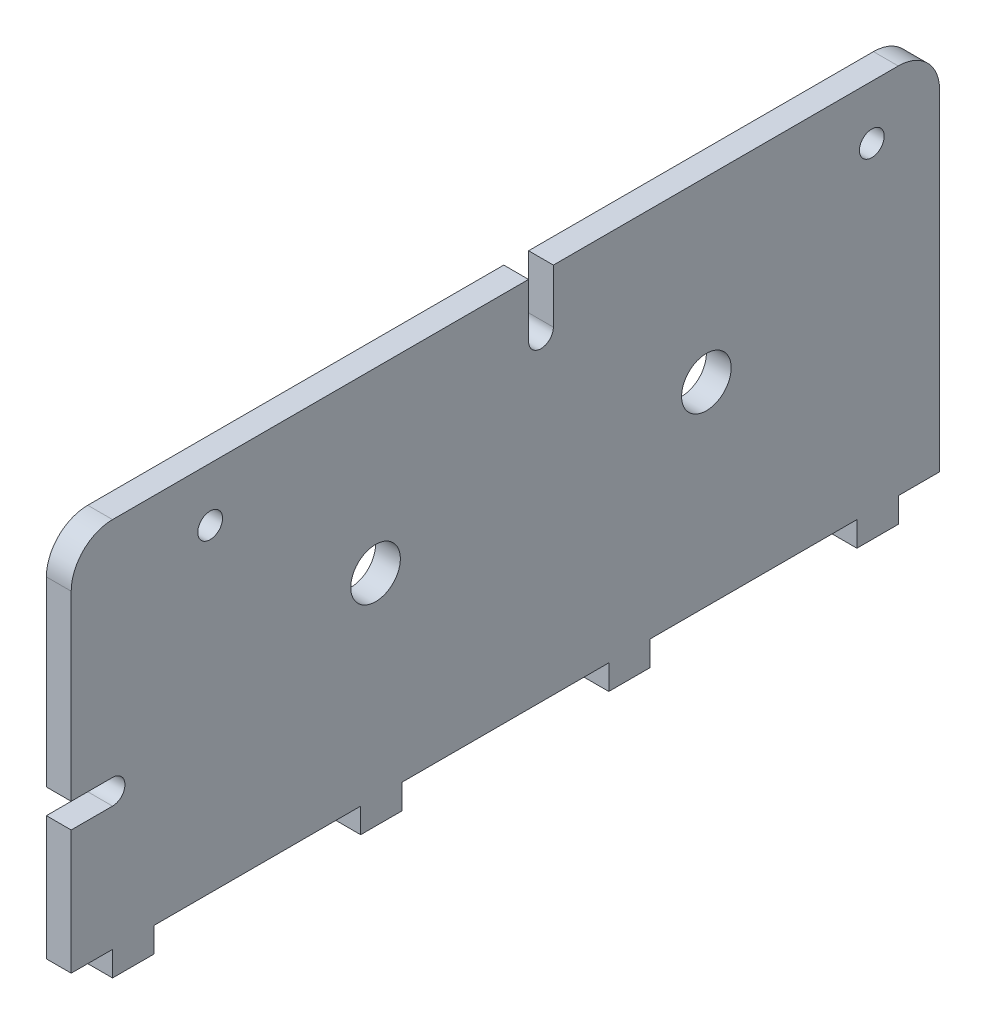
ISO-10303-21;
HEADER;
FILE_DESCRIPTION(('STEP AP214'),'2;1');
FILE_NAME('part.step','',(''),(''),'','','');
FILE_SCHEMA(('AUTOMOTIVE_DESIGN { 1 0 10303 214 1 1 1 1 }'));
ENDSEC;
DATA;
#1=APPLICATION_CONTEXT('core data for automotive mechanical design processes');
#2=APPLICATION_PROTOCOL_DEFINITION('international standard','automotive_design',2000,#1);
#3=PRODUCT_CONTEXT('',#1,'mechanical');
#4=PRODUCT('Part','Part','',(#3));
#5=PRODUCT_RELATED_PRODUCT_CATEGORY('part','',(#4));
#6=PRODUCT_DEFINITION_FORMATION('','',#4);
#7=PRODUCT_DEFINITION_CONTEXT('part definition',#1,'design');
#8=PRODUCT_DEFINITION('design','',#6,#7);
#9=PRODUCT_DEFINITION_SHAPE('','',#8);
#10=(LENGTH_UNIT() NAMED_UNIT(*) SI_UNIT(.MILLI.,.METRE.));
#11=(NAMED_UNIT(*) PLANE_ANGLE_UNIT() SI_UNIT($,.RADIAN.));
#12=(NAMED_UNIT(*) SI_UNIT($,.STERADIAN.) SOLID_ANGLE_UNIT());
#13=UNCERTAINTY_MEASURE_WITH_UNIT(LENGTH_MEASURE(1.E-05),#10,'distance_accuracy_value','');
#14=(GEOMETRIC_REPRESENTATION_CONTEXT(3) GLOBAL_UNCERTAINTY_ASSIGNED_CONTEXT((#13)) GLOBAL_UNIT_ASSIGNED_CONTEXT((#10,
#11,#12)) REPRESENTATION_CONTEXT('',''));
#15=CARTESIAN_POINT('',(0.,0.,0.));
#16=DIRECTION('',(0.,0.,1.));
#17=DIRECTION('',(1.,0.,0.));
#18=AXIS2_PLACEMENT_3D('',#15,#16,#17);
#19=CARTESIAN_POINT('',(3.,0.,-75.));
#20=DIRECTION('',(0.,1.,0.));
#21=DIRECTION('',(0.,0.,1.));
#22=AXIS2_PLACEMENT_3D('',#19,#20,#21);
#23=PLANE('',#22);
#24=DIRECTION('',(0.,0.,-1.));
#25=VECTOR('',#24,1.);
#26=CARTESIAN_POINT('',(0.,0.,-75.));
#27=LINE('',#26,#25);
#28=CARTESIAN_POINT('',(0.,0.,-40.));
#29=VERTEX_POINT('',#28);
#30=CARTESIAN_POINT('',(0.,0.,-65.));
#31=VERTEX_POINT('',#30);
#32=EDGE_CURVE('E532',#29,#31,#27,.T.);
#33=ORIENTED_EDGE('',*,*,#32,.T.);
#34=DIRECTION('',(1.,0.,0.));
#35=VECTOR('',#34,1.);
#36=CARTESIAN_POINT('',(3.,0.,-65.));
#37=LINE('',#36,#35);
#38=CARTESIAN_POINT('',(3.,0.,-65.));
#39=VERTEX_POINT('',#38);
#40=EDGE_CURVE('E62',#31,#39,#37,.T.);
#41=ORIENTED_EDGE('',*,*,#40,.T.);
#42=DIRECTION('',(0.,0.,-1.));
#43=VECTOR('',#42,1.);
#44=CARTESIAN_POINT('',(3.,0.,-75.));
#45=LINE('',#44,#43);
#46=CARTESIAN_POINT('',(3.,0.,-40.));
#47=VERTEX_POINT('',#46);
#48=EDGE_CURVE('E530',#47,#39,#45,.T.);
#49=ORIENTED_EDGE('',*,*,#48,.F.);
#50=DIRECTION('',(-1.,0.,0.));
#51=VECTOR('',#50,1.);
#52=CARTESIAN_POINT('',(3.,0.,-40.));
#53=LINE('',#52,#51);
#54=EDGE_CURVE('E269',#47,#29,#53,.T.);
#55=ORIENTED_EDGE('',*,*,#54,.T.);
#56=EDGE_LOOP('',(#33,#41,#49,#55));
#57=FACE_BOUND('',#56,.T.);
#58=ADVANCED_FACE('F39',(#57),#23,.F.);
#59=CARTESIAN_POINT('',(0.,0.,-10.));
#60=VERTEX_POINT('',#59);
#61=CARTESIAN_POINT('',(0.,0.,-35.));
#62=VERTEX_POINT('',#61);
#63=EDGE_CURVE('E533',#60,#62,#27,.T.);
#64=ORIENTED_EDGE('',*,*,#63,.T.);
#65=DIRECTION('',(1.,0.,0.));
#66=VECTOR('',#65,1.);
#67=CARTESIAN_POINT('',(3.,0.,-35.));
#68=LINE('',#67,#66);
#69=CARTESIAN_POINT('',(3.,0.,-35.));
#70=VERTEX_POINT('',#69);
#71=EDGE_CURVE('E278',#62,#70,#68,.T.);
#72=ORIENTED_EDGE('',*,*,#71,.T.);
#73=CARTESIAN_POINT('',(3.,0.,-9.99999999999999));
#74=VERTEX_POINT('',#73);
#75=EDGE_CURVE('E554',#74,#70,#45,.T.);
#76=ORIENTED_EDGE('',*,*,#75,.F.);
#77=DIRECTION('',(-1.,0.,0.));
#78=VECTOR('',#77,1.);
#79=CARTESIAN_POINT('',(3.,0.,-10.));
#80=LINE('',#79,#78);
#81=EDGE_CURVE('E294',#74,#60,#80,.T.);
#82=ORIENTED_EDGE('',*,*,#81,.T.);
#83=EDGE_LOOP('',(#64,#72,#76,#82));
#84=FACE_BOUND('',#83,.T.);
#85=ADVANCED_FACE('F568',(#84),#23,.F.);
#86=CARTESIAN_POINT('',(0.,0.,20.));
#87=VERTEX_POINT('',#86);
#88=CARTESIAN_POINT('',(0.,0.,-5.));
#89=VERTEX_POINT('',#88);
#90=EDGE_CURVE('E456',#87,#89,#27,.T.);
#91=ORIENTED_EDGE('',*,*,#90,.T.);
#92=DIRECTION('',(1.,0.,0.));
#93=VECTOR('',#92,1.);
#94=CARTESIAN_POINT('',(3.,0.,-5.));
#95=LINE('',#94,#93);
#96=CARTESIAN_POINT('',(3.,0.,-5.));
#97=VERTEX_POINT('',#96);
#98=EDGE_CURVE('E307',#89,#97,#95,.T.);
#99=ORIENTED_EDGE('',*,*,#98,.T.);
#100=CARTESIAN_POINT('',(3.,0.,20.));
#101=VERTEX_POINT('',#100);
#102=EDGE_CURVE('E443',#101,#97,#45,.T.);
#103=ORIENTED_EDGE('',*,*,#102,.F.);
#104=DIRECTION('',(-1.,0.,0.));
#105=VECTOR('',#104,1.);
#106=CARTESIAN_POINT('',(3.,0.,20.));
#107=LINE('',#106,#105);
#108=EDGE_CURVE('E323',#101,#87,#107,.T.);
#109=ORIENTED_EDGE('',*,*,#108,.T.);
#110=EDGE_LOOP('',(#91,#99,#103,#109));
#111=FACE_BOUND('',#110,.T.);
#112=ADVANCED_FACE('F537',(#111),#23,.F.);
#113=CARTESIAN_POINT('',(3.,0.,-70.));
#114=VERTEX_POINT('',#113);
#115=CARTESIAN_POINT('',(3.,0.,-75.));
#116=VERTEX_POINT('',#115);
#117=EDGE_CURVE('E54',#114,#116,#45,.T.);
#118=ORIENTED_EDGE('',*,*,#117,.F.);
#119=DIRECTION('',(-1.,0.,0.));
#120=VECTOR('',#119,1.);
#121=CARTESIAN_POINT('',(3.,0.,-70.));
#122=LINE('',#121,#120);
#123=CARTESIAN_POINT('',(0.,0.,-70.));
#124=VERTEX_POINT('',#123);
#125=EDGE_CURVE('E241',#114,#124,#122,.T.);
#126=ORIENTED_EDGE('',*,*,#125,.T.);
#127=CARTESIAN_POINT('',(0.,0.,-75.));
#128=VERTEX_POINT('',#127);
#129=EDGE_CURVE('E451',#124,#128,#27,.T.);
#130=ORIENTED_EDGE('',*,*,#129,.T.);
#131=DIRECTION('',(-1.,0.,0.));
#132=VECTOR('',#131,1.);
#133=CARTESIAN_POINT('',(3.,0.,-75.));
#134=LINE('',#133,#132);
#135=EDGE_CURVE('E448',#116,#128,#134,.T.);
#136=ORIENTED_EDGE('',*,*,#135,.F.);
#137=EDGE_LOOP('',(#118,#126,#130,#136));
#138=FACE_BOUND('',#137,.T.);
#139=ADVANCED_FACE('F531',(#138),#23,.F.);
#140=CARTESIAN_POINT('',(3.,0.,30.));
#141=DIRECTION('',(0.,0.,-1.));
#142=DIRECTION('',(-1.,0.,0.));
#143=AXIS2_PLACEMENT_3D('',#140,#141,#142);
#144=PLANE('',#143);
#145=DIRECTION('',(0.,-1.,0.));
#146=VECTOR('',#145,1.);
#147=CARTESIAN_POINT('',(3.,0.,30.));
#148=LINE('',#147,#146);
#149=CARTESIAN_POINT('',(3.,15.,30.));
#150=VERTEX_POINT('',#149);
#151=CARTESIAN_POINT('',(3.,0.,30.));
#152=VERTEX_POINT('',#151);
#153=EDGE_CURVE('E438',#150,#152,#148,.T.);
#154=ORIENTED_EDGE('',*,*,#153,.F.);
#155=DIRECTION('',(1.,0.,0.));
#156=VECTOR('',#155,1.);
#157=CARTESIAN_POINT('',(0.,15.,30.));
#158=LINE('',#157,#156);
#159=CARTESIAN_POINT('',(0.,15.,30.));
#160=VERTEX_POINT('',#159);
#161=EDGE_CURVE('E379',#160,#150,#158,.T.);
#162=ORIENTED_EDGE('',*,*,#161,.F.);
#163=DIRECTION('',(0.,-1.,0.));
#164=VECTOR('',#163,1.);
#165=CARTESIAN_POINT('',(0.,0.,30.));
#166=LINE('',#165,#164);
#167=CARTESIAN_POINT('',(0.,0.,30.));
#168=VERTEX_POINT('',#167);
#169=EDGE_CURVE('E433',#160,#168,#166,.T.);
#170=ORIENTED_EDGE('',*,*,#169,.T.);
#171=DIRECTION('',(-1.,0.,0.));
#172=VECTOR('',#171,1.);
#173=CARTESIAN_POINT('',(3.,0.,30.));
#174=LINE('',#173,#172);
#175=EDGE_CURVE('E464',#152,#168,#174,.T.);
#176=ORIENTED_EDGE('',*,*,#175,.F.);
#177=EDGE_LOOP('',(#154,#162,#170,#176));
#178=FACE_BOUND('',#177,.T.);
#179=ADVANCED_FACE('F582',(#178),#144,.F.);
#180=CARTESIAN_POINT('',(3.,45.,-75.));
#181=DIRECTION('',(0.,-1.,0.));
#182=DIRECTION('',(0.,0.,-1.));
#183=AXIS2_PLACEMENT_3D('',#180,#181,#182);
#184=PLANE('',#183);
#185=DIRECTION('',(0.,0.,1.));
#186=VECTOR('',#185,1.);
#187=CARTESIAN_POINT('',(0.,45.,-75.));
#188=LINE('',#187,#186);
#189=CARTESIAN_POINT('',(0.,45.,-25.3));
#190=VERTEX_POINT('',#189);
#191=CARTESIAN_POINT('',(0.,45.,25.));
#192=VERTEX_POINT('',#191);
#193=EDGE_CURVE('E459',#190,#192,#188,.T.);
#194=ORIENTED_EDGE('',*,*,#193,.T.);
#195=DIRECTION('',(-1.,0.,0.));
#196=VECTOR('',#195,1.);
#197=CARTESIAN_POINT('',(3.,45.,25.));
#198=LINE('',#197,#196);
#199=CARTESIAN_POINT('',(3.,45.,25.));
#200=VERTEX_POINT('',#199);
#201=EDGE_CURVE('E11',#192,#200,#198,.F.);
#202=ORIENTED_EDGE('',*,*,#201,.T.);
#203=DIRECTION('',(0.,0.,1.));
#204=VECTOR('',#203,1.);
#205=CARTESIAN_POINT('',(3.,45.,-75.));
#206=LINE('',#205,#204);
#207=CARTESIAN_POINT('',(3.,45.,-25.3));
#208=VERTEX_POINT('',#207);
#209=EDGE_CURVE('E445',#208,#200,#206,.T.);
#210=ORIENTED_EDGE('',*,*,#209,.F.);
#211=DIRECTION('',(1.,0.,0.));
#212=VECTOR('',#211,1.);
#213=CARTESIAN_POINT('',(0.,45.,-25.3));
#214=LINE('',#213,#212);
#215=EDGE_CURVE('E424',#190,#208,#214,.T.);
#216=ORIENTED_EDGE('',*,*,#215,.F.);
#217=EDGE_LOOP('',(#194,#202,#210,#216));
#218=FACE_BOUND('',#217,.T.);
#219=ADVANCED_FACE('F505',(#218),#184,.F.);
#220=CARTESIAN_POINT('',(3.,40.,30.));
#221=VERTEX_POINT('',#220);
#222=CARTESIAN_POINT('',(3.,18.,30.));
#223=VERTEX_POINT('',#222);
#224=EDGE_CURVE('E436',#221,#223,#148,.T.);
#225=ORIENTED_EDGE('',*,*,#224,.F.);
#226=DIRECTION('',(-1.,0.,0.));
#227=VECTOR('',#226,1.);
#228=CARTESIAN_POINT('',(3.,40.,30.));
#229=LINE('',#228,#227);
#230=CARTESIAN_POINT('',(0.,40.,30.));
#231=VERTEX_POINT('',#230);
#232=EDGE_CURVE('E47',#221,#231,#229,.T.);
#233=ORIENTED_EDGE('',*,*,#232,.T.);
#234=CARTESIAN_POINT('',(0.,18.,30.));
#235=VERTEX_POINT('',#234);
#236=EDGE_CURVE('E449',#231,#235,#166,.T.);
#237=ORIENTED_EDGE('',*,*,#236,.T.);
#238=DIRECTION('',(1.,0.,0.));
#239=VECTOR('',#238,1.);
#240=CARTESIAN_POINT('',(0.,18.,30.));
#241=LINE('',#240,#239);
#242=EDGE_CURVE('E381',#235,#223,#241,.T.);
#243=ORIENTED_EDGE('',*,*,#242,.T.);
#244=EDGE_LOOP('',(#225,#233,#237,#243));
#245=FACE_BOUND('',#244,.T.);
#246=ADVANCED_FACE('F484',(#245),#144,.F.);
#247=CARTESIAN_POINT('',(0.,0.,25.));
#248=VERTEX_POINT('',#247);
#249=EDGE_CURVE('E452',#168,#248,#27,.T.);
#250=ORIENTED_EDGE('',*,*,#249,.T.);
#251=DIRECTION('',(1.,0.,0.));
#252=VECTOR('',#251,1.);
#253=CARTESIAN_POINT('',(3.,0.,25.));
#254=LINE('',#253,#252);
#255=CARTESIAN_POINT('',(3.,0.,25.));
#256=VERTEX_POINT('',#255);
#257=EDGE_CURVE('E336',#248,#256,#254,.T.);
#258=ORIENTED_EDGE('',*,*,#257,.T.);
#259=EDGE_CURVE('E439',#152,#256,#45,.T.);
#260=ORIENTED_EDGE('',*,*,#259,.F.);
#261=ORIENTED_EDGE('',*,*,#175,.T.);
#262=EDGE_LOOP('',(#250,#258,#260,#261));
#263=FACE_BOUND('',#262,.T.);
#264=ADVANCED_FACE('F570',(#263),#23,.F.);
#265=CARTESIAN_POINT('',(3.,0.,-75.));
#266=DIRECTION('',(0.,0.,1.));
#267=DIRECTION('',(1.,0.,0.));
#268=AXIS2_PLACEMENT_3D('',#265,#266,#267);
#269=PLANE('',#268);
#270=DIRECTION('',(0.,1.,0.));
#271=VECTOR('',#270,1.);
#272=CARTESIAN_POINT('',(0.,0.,-75.));
#273=LINE('',#272,#271);
#274=CARTESIAN_POINT('',(0.,40.,-75.));
#275=VERTEX_POINT('',#274);
#276=EDGE_CURVE('E455',#128,#275,#273,.T.);
#277=ORIENTED_EDGE('',*,*,#276,.T.);
#278=DIRECTION('',(-1.,0.,0.));
#279=VECTOR('',#278,1.);
#280=CARTESIAN_POINT('',(3.,40.,-75.));
#281=LINE('',#280,#279);
#282=CARTESIAN_POINT('',(3.,40.,-75.));
#283=VERTEX_POINT('',#282);
#284=EDGE_CURVE('E474',#275,#283,#281,.F.);
#285=ORIENTED_EDGE('',*,*,#284,.T.);
#286=DIRECTION('',(0.,1.,0.));
#287=VECTOR('',#286,1.);
#288=CARTESIAN_POINT('',(3.,0.,-75.));
#289=LINE('',#288,#287);
#290=EDGE_CURVE('E442',#116,#283,#289,.T.);
#291=ORIENTED_EDGE('',*,*,#290,.F.);
#292=ORIENTED_EDGE('',*,*,#135,.T.);
#293=EDGE_LOOP('',(#277,#285,#291,#292));
#294=FACE_BOUND('',#293,.T.);
#295=ADVANCED_FACE('F529',(#294),#269,.F.);
#296=CARTESIAN_POINT('',(3.,45.,-70.));
#297=VERTEX_POINT('',#296);
#298=CARTESIAN_POINT('',(3.,45.,-28.3));
#299=VERTEX_POINT('',#298);
#300=EDGE_CURVE('E446',#297,#299,#206,.T.);
#301=ORIENTED_EDGE('',*,*,#300,.F.);
#302=DIRECTION('',(-1.,0.,0.));
#303=VECTOR('',#302,1.);
#304=CARTESIAN_POINT('',(3.,45.,-70.));
#305=LINE('',#304,#303);
#306=CARTESIAN_POINT('',(0.,45.,-70.));
#307=VERTEX_POINT('',#306);
#308=EDGE_CURVE('E467',#297,#307,#305,.T.);
#309=ORIENTED_EDGE('',*,*,#308,.T.);
#310=CARTESIAN_POINT('',(0.,45.,-28.3));
#311=VERTEX_POINT('',#310);
#312=EDGE_CURVE('E460',#307,#311,#188,.T.);
#313=ORIENTED_EDGE('',*,*,#312,.T.);
#314=DIRECTION('',(1.,0.,0.));
#315=VECTOR('',#314,1.);
#316=CARTESIAN_POINT('',(0.,45.,-28.3));
#317=LINE('',#316,#315);
#318=EDGE_CURVE('E426',#311,#299,#317,.T.);
#319=ORIENTED_EDGE('',*,*,#318,.T.);
#320=EDGE_LOOP('',(#301,#309,#313,#319));
#321=FACE_BOUND('',#320,.T.);
#322=ADVANCED_FACE('F521',(#321),#184,.F.);
#323=CARTESIAN_POINT('',(3.,0.,0.));
#324=DIRECTION('',(1.,0.,0.));
#325=DIRECTION('',(0.,0.,-1.));
#326=AXIS2_PLACEMENT_3D('',#323,#324,#325);
#327=PLANE('',#326);
#328=ORIENTED_EDGE('',*,*,#290,.T.);
#329=CARTESIAN_POINT('',(3.,40.,-70.));
#330=DIRECTION('',(1.,0.,0.));
#331=DIRECTION('',(0.,0.,-1.));
#332=AXIS2_PLACEMENT_3D('',#329,#330,#331);
#333=CIRCLE('',#332,5.);
#334=EDGE_CURVE('E478',#283,#297,#333,.T.);
#335=ORIENTED_EDGE('',*,*,#334,.T.);
#336=ORIENTED_EDGE('',*,*,#300,.T.);
#337=DIRECTION('',(0.,1.,0.));
#338=VECTOR('',#337,1.);
#339=CARTESIAN_POINT('',(3.,38.5,-28.3));
#340=LINE('',#339,#338);
#341=CARTESIAN_POINT('',(3.,38.5,-28.3));
#342=VERTEX_POINT('',#341);
#343=EDGE_CURVE('E418',#342,#299,#340,.T.);
#344=ORIENTED_EDGE('',*,*,#343,.F.);
#345=CARTESIAN_POINT('',(3.,38.5,-26.8));
#346=DIRECTION('',(1.,0.,0.));
#347=DIRECTION('',(0.,0.,-1.));
#348=AXIS2_PLACEMENT_3D('',#345,#346,#347);
#349=CIRCLE('',#348,1.5);
#350=CARTESIAN_POINT('',(3.,38.5,-25.3));
#351=VERTEX_POINT('',#350);
#352=EDGE_CURVE('E388',#351,#342,#349,.T.);
#353=ORIENTED_EDGE('',*,*,#352,.F.);
#354=DIRECTION('',(0.,-1.,0.));
#355=VECTOR('',#354,1.);
#356=CARTESIAN_POINT('',(3.,38.5,-25.3));
#357=LINE('',#356,#355);
#358=EDGE_CURVE('E409',#208,#351,#357,.T.);
#359=ORIENTED_EDGE('',*,*,#358,.F.);
#360=ORIENTED_EDGE('',*,*,#209,.T.);
#361=CARTESIAN_POINT('',(3.,40.,25.));
#362=DIRECTION('',(1.,0.,0.));
#363=DIRECTION('',(0.,0.,-1.));
#364=AXIS2_PLACEMENT_3D('',#361,#362,#363);
#365=CIRCLE('',#364,5.);
#366=EDGE_CURVE('E476',#200,#221,#365,.T.);
#367=ORIENTED_EDGE('',*,*,#366,.T.);
#368=ORIENTED_EDGE('',*,*,#224,.T.);
#369=DIRECTION('',(0.,0.,1.));
#370=VECTOR('',#369,1.);
#371=CARTESIAN_POINT('',(3.,18.,25.));
#372=LINE('',#371,#370);
#373=CARTESIAN_POINT('',(3.,18.,25.));
#374=VERTEX_POINT('',#373);
#375=EDGE_CURVE('E371',#374,#223,#372,.T.);
#376=ORIENTED_EDGE('',*,*,#375,.F.);
#377=CARTESIAN_POINT('',(3.,16.5,25.));
#378=DIRECTION('',(1.,0.,0.));
#379=DIRECTION('',(0.,0.,-1.));
#380=AXIS2_PLACEMENT_3D('',#377,#378,#379);
#381=CIRCLE('',#380,1.5);
#382=CARTESIAN_POINT('',(3.,15.,25.));
#383=VERTEX_POINT('',#382);
#384=EDGE_CURVE('E352',#383,#374,#381,.T.);
#385=ORIENTED_EDGE('',*,*,#384,.F.);
#386=DIRECTION('',(0.,0.,-1.));
#387=VECTOR('',#386,1.);
#388=CARTESIAN_POINT('',(3.,15.,25.));
#389=LINE('',#388,#387);
#390=EDGE_CURVE('E362',#150,#383,#389,.T.);
#391=ORIENTED_EDGE('',*,*,#390,.F.);
#392=ORIENTED_EDGE('',*,*,#153,.T.);
#393=ORIENTED_EDGE('',*,*,#259,.T.);
#394=DIRECTION('',(0.,1.,0.));
#395=VECTOR('',#394,1.);
#396=CARTESIAN_POINT('',(3.,-3.,25.));
#397=LINE('',#396,#395);
#398=CARTESIAN_POINT('',(3.,-3.,25.));
#399=VERTEX_POINT('',#398);
#400=EDGE_CURVE('E350',#399,#256,#397,.T.);
#401=ORIENTED_EDGE('',*,*,#400,.F.);
#402=DIRECTION('',(0.,0.,-1.));
#403=VECTOR('',#402,1.);
#404=CARTESIAN_POINT('',(3.,-3.,25.));
#405=LINE('',#404,#403);
#406=CARTESIAN_POINT('',(3.,-3.,20.));
#407=VERTEX_POINT('',#406);
#408=EDGE_CURVE('E332',#399,#407,#405,.T.);
#409=ORIENTED_EDGE('',*,*,#408,.T.);
#410=DIRECTION('',(0.,1.,0.));
#411=VECTOR('',#410,1.);
#412=CARTESIAN_POINT('',(3.,-3.,20.));
#413=LINE('',#412,#411);
#414=EDGE_CURVE('E345',#407,#101,#413,.T.);
#415=ORIENTED_EDGE('',*,*,#414,.T.);
#416=ORIENTED_EDGE('',*,*,#102,.T.);
#417=DIRECTION('',(0.,1.,0.));
#418=VECTOR('',#417,1.);
#419=CARTESIAN_POINT('',(3.,-3.,-5.));
#420=LINE('',#419,#418);
#421=CARTESIAN_POINT('',(3.,-3.,-5.));
#422=VERTEX_POINT('',#421);
#423=EDGE_CURVE('E320',#422,#97,#420,.T.);
#424=ORIENTED_EDGE('',*,*,#423,.F.);
#425=DIRECTION('',(0.,0.,-1.));
#426=VECTOR('',#425,1.);
#427=CARTESIAN_POINT('',(3.,-3.,-5.));
#428=LINE('',#427,#426);
#429=CARTESIAN_POINT('',(3.,-3.,-10.));
#430=VERTEX_POINT('',#429);
#431=EDGE_CURVE('E303',#422,#430,#428,.T.);
#432=ORIENTED_EDGE('',*,*,#431,.T.);
#433=DIRECTION('',(0.,1.,0.));
#434=VECTOR('',#433,1.);
#435=CARTESIAN_POINT('',(3.,-3.,-10.));
#436=LINE('',#435,#434);
#437=EDGE_CURVE('E316',#430,#74,#436,.T.);
#438=ORIENTED_EDGE('',*,*,#437,.T.);
#439=ORIENTED_EDGE('',*,*,#75,.T.);
#440=DIRECTION('',(0.,1.,0.));
#441=VECTOR('',#440,1.);
#442=CARTESIAN_POINT('',(3.,-3.,-35.));
#443=LINE('',#442,#441);
#444=CARTESIAN_POINT('',(3.,-3.,-35.));
#445=VERTEX_POINT('',#444);
#446=EDGE_CURVE('E291',#445,#70,#443,.T.);
#447=ORIENTED_EDGE('',*,*,#446,.F.);
#448=DIRECTION('',(0.,0.,-1.));
#449=VECTOR('',#448,1.);
#450=CARTESIAN_POINT('',(3.,-3.,-35.));
#451=LINE('',#450,#449);
#452=CARTESIAN_POINT('',(3.,-3.,-40.));
#453=VERTEX_POINT('',#452);
#454=EDGE_CURVE('E274',#445,#453,#451,.T.);
#455=ORIENTED_EDGE('',*,*,#454,.T.);
#456=DIRECTION('',(0.,1.,0.));
#457=VECTOR('',#456,1.);
#458=CARTESIAN_POINT('',(3.,-3.,-40.));
#459=LINE('',#458,#457);
#460=EDGE_CURVE('E287',#453,#47,#459,.T.);
#461=ORIENTED_EDGE('',*,*,#460,.T.);
#462=ORIENTED_EDGE('',*,*,#48,.T.);
#463=DIRECTION('',(0.,1.,0.));
#464=VECTOR('',#463,1.);
#465=CARTESIAN_POINT('',(3.,-3.,-65.));
#466=LINE('',#465,#464);
#467=CARTESIAN_POINT('',(3.,-3.,-65.));
#468=VERTEX_POINT('',#467);
#469=EDGE_CURVE('E261',#468,#39,#466,.T.);
#470=ORIENTED_EDGE('',*,*,#469,.F.);
#471=DIRECTION('',(0.,0.,-1.));
#472=VECTOR('',#471,1.);
#473=CARTESIAN_POINT('',(3.,-3.,-65.));
#474=LINE('',#473,#472);
#475=CARTESIAN_POINT('',(3.,-3.,-70.));
#476=VERTEX_POINT('',#475);
#477=EDGE_CURVE('E252',#468,#476,#474,.T.);
#478=ORIENTED_EDGE('',*,*,#477,.T.);
#479=DIRECTION('',(0.,1.,0.));
#480=VECTOR('',#479,1.);
#481=CARTESIAN_POINT('',(3.,-3.,-70.));
#482=LINE('',#481,#480);
#483=EDGE_CURVE('E236',#476,#114,#482,.T.);
#484=ORIENTED_EDGE('',*,*,#483,.T.);
#485=ORIENTED_EDGE('',*,*,#117,.T.);
#486=EDGE_LOOP('',(#328,#335,#336,#344,#353,#359,#360,#367,#368,#376,#385,#391,#392,#393,#401,
#409,#415,#416,#424,#432,#438,#439,#447,#455,#461,#462,#470,#478,#484,#485));
#487=FACE_BOUND('',#486,.T.);
#488=CARTESIAN_POINT('',(3.,23.5,-46.8));
#489=DIRECTION('',(1.,0.,0.));
#490=DIRECTION('',(0.,0.,-1.));
#491=AXIS2_PLACEMENT_3D('',#488,#489,#490);
#492=CIRCLE('',#491,3.);
#493=CARTESIAN_POINT('',(3.,23.5,-49.8));
#494=VERTEX_POINT('',#493);
#495=EDGE_CURVE('E401',#494,#494,#492,.T.);
#496=ORIENTED_EDGE('',*,*,#495,.F.);
#497=EDGE_LOOP('',(#496));
#498=FACE_BOUND('',#497,.T.);
#499=CARTESIAN_POINT('',(3.,38.5,-66.8));
#500=DIRECTION('',(1.,0.,0.));
#501=DIRECTION('',(0.,0.,-1.));
#502=AXIS2_PLACEMENT_3D('',#499,#500,#501);
#503=CIRCLE('',#502,1.5);
#504=CARTESIAN_POINT('',(3.,38.5,-68.3));
#505=VERTEX_POINT('',#504);
#506=EDGE_CURVE('E389',#505,#505,#503,.T.);
#507=ORIENTED_EDGE('',*,*,#506,.F.);
#508=EDGE_LOOP('',(#507));
#509=FACE_BOUND('',#508,.T.);
#510=CARTESIAN_POINT('',(3.,38.5,13.2));
#511=DIRECTION('',(1.,0.,0.));
#512=DIRECTION('',(0.,0.,-1.));
#513=AXIS2_PLACEMENT_3D('',#510,#511,#512);
#514=CIRCLE('',#513,1.5);
#515=CARTESIAN_POINT('',(3.,38.5,11.7));
#516=VERTEX_POINT('',#515);
#517=EDGE_CURVE('E378',#516,#516,#514,.T.);
#518=ORIENTED_EDGE('',*,*,#517,.F.);
#519=EDGE_LOOP('',(#518));
#520=FACE_BOUND('',#519,.T.);
#521=CARTESIAN_POINT('',(3.,23.5,-6.8));
#522=DIRECTION('',(1.,0.,0.));
#523=DIRECTION('',(0.,0.,-1.));
#524=AXIS2_PLACEMENT_3D('',#521,#522,#523);
#525=CIRCLE('',#524,3.);
#526=CARTESIAN_POINT('',(3.,23.5,-9.8));
#527=VERTEX_POINT('',#526);
#528=EDGE_CURVE('E400',#527,#527,#525,.T.);
#529=ORIENTED_EDGE('',*,*,#528,.F.);
#530=EDGE_LOOP('',(#529));
#531=FACE_BOUND('',#530,.T.);
#532=ADVANCED_FACE('F258',(#487,#498,#509,#520,#531),#327,.T.);
#533=CARTESIAN_POINT('',(0.,0.,0.));
#534=DIRECTION('',(1.,0.,0.));
#535=DIRECTION('',(0.,0.,-1.));
#536=AXIS2_PLACEMENT_3D('',#533,#534,#535);
#537=PLANE('',#536);
#538=CARTESIAN_POINT('',(0.,23.5,-46.8));
#539=DIRECTION('',(1.,0.,0.));
#540=DIRECTION('',(0.,0.,-1.));
#541=AXIS2_PLACEMENT_3D('',#538,#539,#540);
#542=CIRCLE('',#541,3.);
#543=CARTESIAN_POINT('',(0.,23.5,-49.8));
#544=VERTEX_POINT('',#543);
#545=EDGE_CURVE('E397',#544,#544,#542,.T.);
#546=ORIENTED_EDGE('',*,*,#545,.T.);
#547=EDGE_LOOP('',(#546));
#548=FACE_BOUND('',#547,.T.);
#549=CARTESIAN_POINT('',(0.,38.5,-66.8));
#550=DIRECTION('',(1.,0.,0.));
#551=DIRECTION('',(0.,0.,-1.));
#552=AXIS2_PLACEMENT_3D('',#549,#550,#551);
#553=CIRCLE('',#552,1.5);
#554=CARTESIAN_POINT('',(0.,38.5,-68.3));
#555=VERTEX_POINT('',#554);
#556=EDGE_CURVE('E385',#555,#555,#553,.T.);
#557=ORIENTED_EDGE('',*,*,#556,.T.);
#558=EDGE_LOOP('',(#557));
#559=FACE_BOUND('',#558,.T.);
#560=CARTESIAN_POINT('',(0.,38.5,13.2));
#561=DIRECTION('',(1.,0.,0.));
#562=DIRECTION('',(0.,0.,-1.));
#563=AXIS2_PLACEMENT_3D('',#560,#561,#562);
#564=CIRCLE('',#563,1.5);
#565=CARTESIAN_POINT('',(0.,38.5,11.7));
#566=VERTEX_POINT('',#565);
#567=EDGE_CURVE('E392',#566,#566,#564,.T.);
#568=ORIENTED_EDGE('',*,*,#567,.T.);
#569=EDGE_LOOP('',(#568));
#570=FACE_BOUND('',#569,.T.);
#571=CARTESIAN_POINT('',(0.,23.5,-6.8));
#572=DIRECTION('',(1.,0.,0.));
#573=DIRECTION('',(0.,0.,-1.));
#574=AXIS2_PLACEMENT_3D('',#571,#572,#573);
#575=CIRCLE('',#574,3.);
#576=CARTESIAN_POINT('',(0.,23.5,-9.8));
#577=VERTEX_POINT('',#576);
#578=EDGE_CURVE('E430',#577,#577,#575,.T.);
#579=ORIENTED_EDGE('',*,*,#578,.T.);
#580=EDGE_LOOP('',(#579));
#581=FACE_BOUND('',#580,.T.);
#582=ORIENTED_EDGE('',*,*,#312,.F.);
#583=CARTESIAN_POINT('',(0.,40.,-70.));
#584=DIRECTION('',(1.,0.,0.));
#585=DIRECTION('',(0.,0.,-1.));
#586=AXIS2_PLACEMENT_3D('',#583,#584,#585);
#587=CIRCLE('',#586,5.);
#588=EDGE_CURVE('E472',#307,#275,#587,.F.);
#589=ORIENTED_EDGE('',*,*,#588,.T.);
#590=ORIENTED_EDGE('',*,*,#276,.F.);
#591=ORIENTED_EDGE('',*,*,#129,.F.);
#592=DIRECTION('',(0.,1.,0.));
#593=VECTOR('',#592,1.);
#594=CARTESIAN_POINT('',(0.,-3.,-70.));
#595=LINE('',#594,#593);
#596=CARTESIAN_POINT('',(0.,-3.,-70.));
#597=VERTEX_POINT('',#596);
#598=EDGE_CURVE('E244',#597,#124,#595,.T.);
#599=ORIENTED_EDGE('',*,*,#598,.F.);
#600=DIRECTION('',(0.,0.,1.));
#601=VECTOR('',#600,1.);
#602=CARTESIAN_POINT('',(0.,-3.,-65.));
#603=LINE('',#602,#601);
#604=CARTESIAN_POINT('',(0.,-3.,-65.));
#605=VERTEX_POINT('',#604);
#606=EDGE_CURVE('E255',#597,#605,#603,.T.);
#607=ORIENTED_EDGE('',*,*,#606,.T.);
#608=DIRECTION('',(0.,1.,0.));
#609=VECTOR('',#608,1.);
#610=CARTESIAN_POINT('',(0.,-3.,-65.));
#611=LINE('',#610,#609);
#612=EDGE_CURVE('E270',#605,#31,#611,.T.);
#613=ORIENTED_EDGE('',*,*,#612,.T.);
#614=ORIENTED_EDGE('',*,*,#32,.F.);
#615=DIRECTION('',(0.,1.,0.));
#616=VECTOR('',#615,1.);
#617=CARTESIAN_POINT('',(0.,-3.,-40.));
#618=LINE('',#617,#616);
#619=CARTESIAN_POINT('',(0.,-3.,-40.));
#620=VERTEX_POINT('',#619);
#621=EDGE_CURVE('E298',#620,#29,#618,.T.);
#622=ORIENTED_EDGE('',*,*,#621,.F.);
#623=DIRECTION('',(0.,0.,1.));
#624=VECTOR('',#623,1.);
#625=CARTESIAN_POINT('',(0.,-3.,-35.));
#626=LINE('',#625,#624);
#627=CARTESIAN_POINT('',(0.,-3.,-35.));
#628=VERTEX_POINT('',#627);
#629=EDGE_CURVE('E281',#620,#628,#626,.T.);
#630=ORIENTED_EDGE('',*,*,#629,.T.);
#631=DIRECTION('',(0.,1.,0.));
#632=VECTOR('',#631,1.);
#633=CARTESIAN_POINT('',(0.,-3.,-35.));
#634=LINE('',#633,#632);
#635=EDGE_CURVE('E295',#628,#62,#634,.T.);
#636=ORIENTED_EDGE('',*,*,#635,.T.);
#637=ORIENTED_EDGE('',*,*,#63,.F.);
#638=DIRECTION('',(0.,1.,0.));
#639=VECTOR('',#638,1.);
#640=CARTESIAN_POINT('',(0.,-3.,-10.));
#641=LINE('',#640,#639);
#642=CARTESIAN_POINT('',(0.,-3.,-10.));
#643=VERTEX_POINT('',#642);
#644=EDGE_CURVE('E327',#643,#60,#641,.T.);
#645=ORIENTED_EDGE('',*,*,#644,.F.);
#646=DIRECTION('',(0.,0.,1.));
#647=VECTOR('',#646,1.);
#648=CARTESIAN_POINT('',(0.,-3.,-5.));
#649=LINE('',#648,#647);
#650=CARTESIAN_POINT('',(0.,-3.,-5.));
#651=VERTEX_POINT('',#650);
#652=EDGE_CURVE('E310',#643,#651,#649,.T.);
#653=ORIENTED_EDGE('',*,*,#652,.T.);
#654=DIRECTION('',(0.,1.,0.));
#655=VECTOR('',#654,1.);
#656=CARTESIAN_POINT('',(0.,-3.,-5.));
#657=LINE('',#656,#655);
#658=EDGE_CURVE('E324',#651,#89,#657,.T.);
#659=ORIENTED_EDGE('',*,*,#658,.T.);
#660=ORIENTED_EDGE('',*,*,#90,.F.);
#661=DIRECTION('',(0.,1.,0.));
#662=VECTOR('',#661,1.);
#663=CARTESIAN_POINT('',(0.,-3.,20.));
#664=LINE('',#663,#662);
#665=CARTESIAN_POINT('',(0.,-3.,20.));
#666=VERTEX_POINT('',#665);
#667=EDGE_CURVE('E355',#666,#87,#664,.T.);
#668=ORIENTED_EDGE('',*,*,#667,.F.);
#669=DIRECTION('',(0.,0.,1.));
#670=VECTOR('',#669,1.);
#671=CARTESIAN_POINT('',(0.,-3.,25.));
#672=LINE('',#671,#670);
#673=CARTESIAN_POINT('',(0.,-3.,25.));
#674=VERTEX_POINT('',#673);
#675=EDGE_CURVE('E339',#666,#674,#672,.T.);
#676=ORIENTED_EDGE('',*,*,#675,.T.);
#677=DIRECTION('',(0.,1.,0.));
#678=VECTOR('',#677,1.);
#679=CARTESIAN_POINT('',(0.,-3.,25.));
#680=LINE('',#679,#678);
#681=EDGE_CURVE('E353',#674,#248,#680,.T.);
#682=ORIENTED_EDGE('',*,*,#681,.T.);
#683=ORIENTED_EDGE('',*,*,#249,.F.);
#684=ORIENTED_EDGE('',*,*,#169,.F.);
#685=DIRECTION('',(0.,0.,-1.));
#686=VECTOR('',#685,1.);
#687=CARTESIAN_POINT('',(0.,15.,25.));
#688=LINE('',#687,#686);
#689=CARTESIAN_POINT('',(0.,15.,25.));
#690=VERTEX_POINT('',#689);
#691=EDGE_CURVE('E365',#160,#690,#688,.T.);
#692=ORIENTED_EDGE('',*,*,#691,.T.);
#693=CARTESIAN_POINT('',(0.,16.5,25.));
#694=DIRECTION('',(1.,0.,0.));
#695=DIRECTION('',(0.,0.,-1.));
#696=AXIS2_PLACEMENT_3D('',#693,#694,#695);
#697=CIRCLE('',#696,1.5);
#698=CARTESIAN_POINT('',(0.,18.,25.));
#699=VERTEX_POINT('',#698);
#700=EDGE_CURVE('E358',#690,#699,#697,.T.);
#701=ORIENTED_EDGE('',*,*,#700,.T.);
#702=DIRECTION('',(0.,0.,1.));
#703=VECTOR('',#702,1.);
#704=CARTESIAN_POINT('',(0.,18.,25.));
#705=LINE('',#704,#703);
#706=EDGE_CURVE('E361',#699,#235,#705,.T.);
#707=ORIENTED_EDGE('',*,*,#706,.T.);
#708=ORIENTED_EDGE('',*,*,#236,.F.);
#709=CARTESIAN_POINT('',(0.,40.,25.));
#710=DIRECTION('',(1.,0.,0.));
#711=DIRECTION('',(0.,0.,-1.));
#712=AXIS2_PLACEMENT_3D('',#709,#710,#711);
#713=CIRCLE('',#712,5.);
#714=EDGE_CURVE('E470',#231,#192,#713,.F.);
#715=ORIENTED_EDGE('',*,*,#714,.T.);
#716=ORIENTED_EDGE('',*,*,#193,.F.);
#717=DIRECTION('',(0.,-1.,0.));
#718=VECTOR('',#717,1.);
#719=CARTESIAN_POINT('',(0.,38.5,-25.3));
#720=LINE('',#719,#718);
#721=CARTESIAN_POINT('',(0.,38.5,-25.3));
#722=VERTEX_POINT('',#721);
#723=EDGE_CURVE('E412',#190,#722,#720,.T.);
#724=ORIENTED_EDGE('',*,*,#723,.T.);
#725=CARTESIAN_POINT('',(0.,38.5,-26.8));
#726=DIRECTION('',(1.,0.,0.));
#727=DIRECTION('',(0.,0.,-1.));
#728=AXIS2_PLACEMENT_3D('',#725,#726,#727);
#729=CIRCLE('',#728,1.5);
#730=CARTESIAN_POINT('',(0.,38.5,-28.3));
#731=VERTEX_POINT('',#730);
#732=EDGE_CURVE('E405',#722,#731,#729,.T.);
#733=ORIENTED_EDGE('',*,*,#732,.T.);
#734=DIRECTION('',(0.,1.,0.));
#735=VECTOR('',#734,1.);
#736=CARTESIAN_POINT('',(0.,38.5,-28.3));
#737=LINE('',#736,#735);
#738=EDGE_CURVE('E408',#731,#311,#737,.T.);
#739=ORIENTED_EDGE('',*,*,#738,.T.);
#740=EDGE_LOOP('',(#582,#589,#590,#591,#599,#607,#613,#614,#622,#630,#636,#637,#645,#653,#659,
#660,#668,#676,#682,#683,#684,#692,#701,#707,#708,#715,#716,#724,#733,#739));
#741=FACE_BOUND('',#740,.T.);
#742=ADVANCED_FACE('F490',(#548,#559,#570,#581,#741),#537,.F.);
#743=CARTESIAN_POINT('',(0.,23.5,-6.8));
#744=DIRECTION('',(1.,0.,0.));
#745=DIRECTION('',(0.,0.,-1.));
#746=AXIS2_PLACEMENT_3D('',#743,#744,#745);
#747=CYLINDRICAL_SURFACE('',#746,3.);
#748=ORIENTED_EDGE('',*,*,#578,.F.);
#749=EDGE_LOOP('',(#748));
#750=FACE_BOUND('',#749,.T.);
#751=ORIENTED_EDGE('',*,*,#528,.T.);
#752=EDGE_LOOP('',(#751));
#753=FACE_BOUND('',#752,.T.);
#754=ADVANCED_FACE('F772',(#750,#753),#747,.F.);
#755=CARTESIAN_POINT('',(0.,38.5,13.2));
#756=DIRECTION('',(1.,0.,0.));
#757=DIRECTION('',(0.,0.,-1.));
#758=AXIS2_PLACEMENT_3D('',#755,#756,#757);
#759=CYLINDRICAL_SURFACE('',#758,1.5);
#760=ORIENTED_EDGE('',*,*,#567,.F.);
#761=EDGE_LOOP('',(#760));
#762=FACE_BOUND('',#761,.T.);
#763=ORIENTED_EDGE('',*,*,#517,.T.);
#764=EDGE_LOOP('',(#763));
#765=FACE_BOUND('',#764,.T.);
#766=ADVANCED_FACE('F762',(#762,#765),#759,.F.);
#767=CARTESIAN_POINT('',(0.,38.5,-66.8));
#768=DIRECTION('',(1.,0.,0.));
#769=DIRECTION('',(0.,0.,-1.));
#770=AXIS2_PLACEMENT_3D('',#767,#768,#769);
#771=CYLINDRICAL_SURFACE('',#770,1.5);
#772=ORIENTED_EDGE('',*,*,#556,.F.);
#773=EDGE_LOOP('',(#772));
#774=FACE_BOUND('',#773,.T.);
#775=ORIENTED_EDGE('',*,*,#506,.T.);
#776=EDGE_LOOP('',(#775));
#777=FACE_BOUND('',#776,.T.);
#778=ADVANCED_FACE('F753',(#774,#777),#771,.F.);
#779=CARTESIAN_POINT('',(0.,38.5,-26.8));
#780=DIRECTION('',(1.,0.,0.));
#781=DIRECTION('',(0.,0.,-1.));
#782=AXIS2_PLACEMENT_3D('',#779,#780,#781);
#783=CYLINDRICAL_SURFACE('',#782,1.5);
#784=ORIENTED_EDGE('',*,*,#352,.T.);
#785=DIRECTION('',(1.,0.,0.));
#786=VECTOR('',#785,1.);
#787=CARTESIAN_POINT('',(0.,38.5,-28.3));
#788=LINE('',#787,#786);
#789=EDGE_CURVE('E415',#731,#342,#788,.T.);
#790=ORIENTED_EDGE('',*,*,#789,.F.);
#791=ORIENTED_EDGE('',*,*,#732,.F.);
#792=DIRECTION('',(1.,0.,0.));
#793=VECTOR('',#792,1.);
#794=CARTESIAN_POINT('',(0.,38.5,-25.3));
#795=LINE('',#794,#793);
#796=EDGE_CURVE('E404',#722,#351,#795,.T.);
#797=ORIENTED_EDGE('',*,*,#796,.T.);
#798=EDGE_LOOP('',(#784,#790,#791,#797));
#799=FACE_BOUND('',#798,.T.);
#800=ADVANCED_FACE('F512',(#799),#783,.F.);
#801=CARTESIAN_POINT('',(0.,38.5,-25.3));
#802=DIRECTION('',(0.,0.,1.));
#803=DIRECTION('',(0.,-1.,0.));
#804=AXIS2_PLACEMENT_3D('',#801,#802,#803);
#805=PLANE('',#804);
#806=ORIENTED_EDGE('',*,*,#358,.T.);
#807=ORIENTED_EDGE('',*,*,#796,.F.);
#808=ORIENTED_EDGE('',*,*,#723,.F.);
#809=ORIENTED_EDGE('',*,*,#215,.T.);
#810=EDGE_LOOP('',(#806,#807,#808,#809));
#811=FACE_BOUND('',#810,.T.);
#812=ADVANCED_FACE('F509',(#811),#805,.F.);
#813=CARTESIAN_POINT('',(0.,38.5,-28.3));
#814=DIRECTION('',(0.,0.,-1.));
#815=DIRECTION('',(0.,1.,0.));
#816=AXIS2_PLACEMENT_3D('',#813,#814,#815);
#817=PLANE('',#816);
#818=ORIENTED_EDGE('',*,*,#343,.T.);
#819=ORIENTED_EDGE('',*,*,#318,.F.);
#820=ORIENTED_EDGE('',*,*,#738,.F.);
#821=ORIENTED_EDGE('',*,*,#789,.T.);
#822=EDGE_LOOP('',(#818,#819,#820,#821));
#823=FACE_BOUND('',#822,.T.);
#824=ADVANCED_FACE('F517',(#823),#817,.F.);
#825=CARTESIAN_POINT('',(0.,23.5,-46.8));
#826=DIRECTION('',(1.,0.,0.));
#827=DIRECTION('',(0.,0.,-1.));
#828=AXIS2_PLACEMENT_3D('',#825,#826,#827);
#829=CYLINDRICAL_SURFACE('',#828,3.);
#830=ORIENTED_EDGE('',*,*,#545,.F.);
#831=EDGE_LOOP('',(#830));
#832=FACE_BOUND('',#831,.T.);
#833=ORIENTED_EDGE('',*,*,#495,.T.);
#834=EDGE_LOOP('',(#833));
#835=FACE_BOUND('',#834,.T.);
#836=ADVANCED_FACE('F710',(#832,#835),#829,.F.);
#837=CARTESIAN_POINT('',(0.,16.5,25.));
#838=DIRECTION('',(1.,0.,0.));
#839=DIRECTION('',(0.,0.,-1.));
#840=AXIS2_PLACEMENT_3D('',#837,#838,#839);
#841=CYLINDRICAL_SURFACE('',#840,1.5);
#842=ORIENTED_EDGE('',*,*,#384,.T.);
#843=DIRECTION('',(1.,0.,0.));
#844=VECTOR('',#843,1.);
#845=CARTESIAN_POINT('',(0.,18.,25.));
#846=LINE('',#845,#844);
#847=EDGE_CURVE('E368',#699,#374,#846,.T.);
#848=ORIENTED_EDGE('',*,*,#847,.F.);
#849=ORIENTED_EDGE('',*,*,#700,.F.);
#850=DIRECTION('',(1.,0.,0.));
#851=VECTOR('',#850,1.);
#852=CARTESIAN_POINT('',(0.,15.,25.));
#853=LINE('',#852,#851);
#854=EDGE_CURVE('E376',#690,#383,#853,.T.);
#855=ORIENTED_EDGE('',*,*,#854,.T.);
#856=EDGE_LOOP('',(#842,#848,#849,#855));
#857=FACE_BOUND('',#856,.T.);
#858=ADVANCED_FACE('F700',(#857),#841,.F.);
#859=CARTESIAN_POINT('',(0.,15.,25.));
#860=DIRECTION('',(0.,-1.,0.));
#861=DIRECTION('',(0.,0.,-1.));
#862=AXIS2_PLACEMENT_3D('',#859,#860,#861);
#863=PLANE('',#862);
#864=ORIENTED_EDGE('',*,*,#390,.T.);
#865=ORIENTED_EDGE('',*,*,#854,.F.);
#866=ORIENTED_EDGE('',*,*,#691,.F.);
#867=ORIENTED_EDGE('',*,*,#161,.T.);
#868=EDGE_LOOP('',(#864,#865,#866,#867));
#869=FACE_BOUND('',#868,.T.);
#870=ADVANCED_FACE('F691',(#869),#863,.F.);
#871=CARTESIAN_POINT('',(0.,18.,25.));
#872=DIRECTION('',(0.,1.,0.));
#873=DIRECTION('',(0.,0.,1.));
#874=AXIS2_PLACEMENT_3D('',#871,#872,#873);
#875=PLANE('',#874);
#876=ORIENTED_EDGE('',*,*,#375,.T.);
#877=ORIENTED_EDGE('',*,*,#242,.F.);
#878=ORIENTED_EDGE('',*,*,#706,.F.);
#879=ORIENTED_EDGE('',*,*,#847,.T.);
#880=EDGE_LOOP('',(#876,#877,#878,#879));
#881=FACE_BOUND('',#880,.T.);
#882=ADVANCED_FACE('F496',(#881),#875,.F.);
#883=CARTESIAN_POINT('',(3.,40.,-70.));
#884=DIRECTION('',(-1.,0.,0.));
#885=DIRECTION('',(0.,0.,1.));
#886=AXIS2_PLACEMENT_3D('',#883,#884,#885);
#887=CYLINDRICAL_SURFACE('',#886,5.);
#888=ORIENTED_EDGE('',*,*,#334,.F.);
#889=ORIENTED_EDGE('',*,*,#284,.F.);
#890=ORIENTED_EDGE('',*,*,#588,.F.);
#891=ORIENTED_EDGE('',*,*,#308,.F.);
#892=EDGE_LOOP('',(#888,#889,#890,#891));
#893=FACE_BOUND('',#892,.T.);
#894=ADVANCED_FACE('F525',(#893),#887,.T.);
#895=CARTESIAN_POINT('',(3.,40.,25.));
#896=DIRECTION('',(-1.,0.,0.));
#897=DIRECTION('',(0.,0.,1.));
#898=AXIS2_PLACEMENT_3D('',#895,#896,#897);
#899=CYLINDRICAL_SURFACE('',#898,5.);
#900=ORIENTED_EDGE('',*,*,#366,.F.);
#901=ORIENTED_EDGE('',*,*,#201,.F.);
#902=ORIENTED_EDGE('',*,*,#714,.F.);
#903=ORIENTED_EDGE('',*,*,#232,.F.);
#904=EDGE_LOOP('',(#900,#901,#902,#903));
#905=FACE_BOUND('',#904,.T.);
#906=ADVANCED_FACE('F41',(#905),#899,.T.);
#907=CARTESIAN_POINT('',(3.,-3.,25.));
#908=DIRECTION('',(0.,0.,1.));
#909=DIRECTION('',(1.,0.,0.));
#910=AXIS2_PLACEMENT_3D('',#907,#908,#909);
#911=PLANE('',#910);
#912=ORIENTED_EDGE('',*,*,#257,.F.);
#913=ORIENTED_EDGE('',*,*,#681,.F.);
#914=DIRECTION('',(1.,0.,0.));
#915=VECTOR('',#914,1.);
#916=CARTESIAN_POINT('',(3.,-3.,25.));
#917=LINE('',#916,#915);
#918=EDGE_CURVE('E342',#674,#399,#917,.T.);
#919=ORIENTED_EDGE('',*,*,#918,.T.);
#920=ORIENTED_EDGE('',*,*,#400,.T.);
#921=EDGE_LOOP('',(#912,#913,#919,#920));
#922=FACE_BOUND('',#921,.T.);
#923=ADVANCED_FACE('F621',(#922),#911,.T.);
#924=CARTESIAN_POINT('',(3.,-3.,20.));
#925=DIRECTION('',(0.,0.,-1.));
#926=DIRECTION('',(-1.,0.,0.));
#927=AXIS2_PLACEMENT_3D('',#924,#925,#926);
#928=PLANE('',#927);
#929=ORIENTED_EDGE('',*,*,#108,.F.);
#930=ORIENTED_EDGE('',*,*,#414,.F.);
#931=DIRECTION('',(-1.,0.,0.));
#932=VECTOR('',#931,1.);
#933=CARTESIAN_POINT('',(3.,-3.,20.));
#934=LINE('',#933,#932);
#935=EDGE_CURVE('E335',#407,#666,#934,.T.);
#936=ORIENTED_EDGE('',*,*,#935,.T.);
#937=ORIENTED_EDGE('',*,*,#667,.T.);
#938=EDGE_LOOP('',(#929,#930,#936,#937));
#939=FACE_BOUND('',#938,.T.);
#940=ADVANCED_FACE('F610',(#939),#928,.T.);
#941=CARTESIAN_POINT('',(0.,-3.,0.));
#942=DIRECTION('',(0.,1.,0.));
#943=DIRECTION('',(0.,0.,1.));
#944=AXIS2_PLACEMENT_3D('',#941,#942,#943);
#945=PLANE('',#944);
#946=ORIENTED_EDGE('',*,*,#408,.F.);
#947=ORIENTED_EDGE('',*,*,#918,.F.);
#948=ORIENTED_EDGE('',*,*,#675,.F.);
#949=ORIENTED_EDGE('',*,*,#935,.F.);
#950=EDGE_LOOP('',(#946,#947,#948,#949));
#951=FACE_BOUND('',#950,.T.);
#952=ADVANCED_FACE('F605',(#951),#945,.F.);
#953=CARTESIAN_POINT('',(3.,-3.,-5.));
#954=DIRECTION('',(0.,0.,1.));
#955=DIRECTION('',(1.,0.,0.));
#956=AXIS2_PLACEMENT_3D('',#953,#954,#955);
#957=PLANE('',#956);
#958=ORIENTED_EDGE('',*,*,#98,.F.);
#959=ORIENTED_EDGE('',*,*,#658,.F.);
#960=DIRECTION('',(1.,0.,0.));
#961=VECTOR('',#960,1.);
#962=CARTESIAN_POINT('',(3.,-3.,-5.));
#963=LINE('',#962,#961);
#964=EDGE_CURVE('E313',#651,#422,#963,.T.);
#965=ORIENTED_EDGE('',*,*,#964,.T.);
#966=ORIENTED_EDGE('',*,*,#423,.T.);
#967=EDGE_LOOP('',(#958,#959,#965,#966));
#968=FACE_BOUND('',#967,.T.);
#969=ADVANCED_FACE('F545',(#968),#957,.T.);
#970=CARTESIAN_POINT('',(3.,-3.,-10.));
#971=DIRECTION('',(0.,0.,-1.));
#972=DIRECTION('',(-1.,0.,0.));
#973=AXIS2_PLACEMENT_3D('',#970,#971,#972);
#974=PLANE('',#973);
#975=ORIENTED_EDGE('',*,*,#81,.F.);
#976=ORIENTED_EDGE('',*,*,#437,.F.);
#977=DIRECTION('',(-1.,0.,0.));
#978=VECTOR('',#977,1.);
#979=CARTESIAN_POINT('',(3.,-3.,-10.));
#980=LINE('',#979,#978);
#981=EDGE_CURVE('E306',#430,#643,#980,.T.);
#982=ORIENTED_EDGE('',*,*,#981,.T.);
#983=ORIENTED_EDGE('',*,*,#644,.T.);
#984=EDGE_LOOP('',(#975,#976,#982,#983));
#985=FACE_BOUND('',#984,.T.);
#986=ADVANCED_FACE('F552',(#985),#974,.T.);
#987=CARTESIAN_POINT('',(0.,-3.,-30.));
#988=DIRECTION('',(0.,1.,0.));
#989=DIRECTION('',(0.,0.,1.));
#990=AXIS2_PLACEMENT_3D('',#987,#988,#989);
#991=PLANE('',#990);
#992=ORIENTED_EDGE('',*,*,#431,.F.);
#993=ORIENTED_EDGE('',*,*,#964,.F.);
#994=ORIENTED_EDGE('',*,*,#652,.F.);
#995=ORIENTED_EDGE('',*,*,#981,.F.);
#996=EDGE_LOOP('',(#992,#993,#994,#995));
#997=FACE_BOUND('',#996,.T.);
#998=ADVANCED_FACE('F549',(#997),#991,.F.);
#999=CARTESIAN_POINT('',(3.,-3.,-35.));
#1000=DIRECTION('',(0.,0.,1.));
#1001=DIRECTION('',(1.,0.,0.));
#1002=AXIS2_PLACEMENT_3D('',#999,#1000,#1001);
#1003=PLANE('',#1002);
#1004=ORIENTED_EDGE('',*,*,#71,.F.);
#1005=ORIENTED_EDGE('',*,*,#635,.F.);
#1006=DIRECTION('',(1.,0.,0.));
#1007=VECTOR('',#1006,1.);
#1008=CARTESIAN_POINT('',(3.,-3.,-35.));
#1009=LINE('',#1008,#1007);
#1010=EDGE_CURVE('E284',#628,#445,#1009,.T.);
#1011=ORIENTED_EDGE('',*,*,#1010,.T.);
#1012=ORIENTED_EDGE('',*,*,#446,.T.);
#1013=EDGE_LOOP('',(#1004,#1005,#1011,#1012));
#1014=FACE_BOUND('',#1013,.T.);
#1015=ADVANCED_FACE('F558',(#1014),#1003,.T.);
#1016=CARTESIAN_POINT('',(3.,-3.,-40.));
#1017=DIRECTION('',(0.,0.,-1.));
#1018=DIRECTION('',(-1.,0.,0.));
#1019=AXIS2_PLACEMENT_3D('',#1016,#1017,#1018);
#1020=PLANE('',#1019);
#1021=ORIENTED_EDGE('',*,*,#54,.F.);
#1022=ORIENTED_EDGE('',*,*,#460,.F.);
#1023=DIRECTION('',(-1.,0.,0.));
#1024=VECTOR('',#1023,1.);
#1025=CARTESIAN_POINT('',(3.,-3.,-40.));
#1026=LINE('',#1025,#1024);
#1027=EDGE_CURVE('E277',#453,#620,#1026,.T.);
#1028=ORIENTED_EDGE('',*,*,#1027,.T.);
#1029=ORIENTED_EDGE('',*,*,#621,.T.);
#1030=EDGE_LOOP('',(#1021,#1022,#1028,#1029));
#1031=FACE_BOUND('',#1030,.T.);
#1032=ADVANCED_FACE('F566',(#1031),#1020,.T.);
#1033=CARTESIAN_POINT('',(0.,-3.,-60.));
#1034=DIRECTION('',(0.,1.,0.));
#1035=DIRECTION('',(0.,0.,1.));
#1036=AXIS2_PLACEMENT_3D('',#1033,#1034,#1035);
#1037=PLANE('',#1036);
#1038=ORIENTED_EDGE('',*,*,#454,.F.);
#1039=ORIENTED_EDGE('',*,*,#1010,.F.);
#1040=ORIENTED_EDGE('',*,*,#629,.F.);
#1041=ORIENTED_EDGE('',*,*,#1027,.F.);
#1042=EDGE_LOOP('',(#1038,#1039,#1040,#1041));
#1043=FACE_BOUND('',#1042,.T.);
#1044=ADVANCED_FACE('F562',(#1043),#1037,.F.);
#1045=CARTESIAN_POINT('',(3.,-3.,-65.));
#1046=DIRECTION('',(0.,0.,1.));
#1047=DIRECTION('',(1.,0.,0.));
#1048=AXIS2_PLACEMENT_3D('',#1045,#1046,#1047);
#1049=PLANE('',#1048);
#1050=ORIENTED_EDGE('',*,*,#40,.F.);
#1051=ORIENTED_EDGE('',*,*,#612,.F.);
#1052=DIRECTION('',(1.,0.,0.));
#1053=VECTOR('',#1052,1.);
#1054=CARTESIAN_POINT('',(3.,-3.,-65.));
#1055=LINE('',#1054,#1053);
#1056=EDGE_CURVE('E245',#605,#468,#1055,.T.);
#1057=ORIENTED_EDGE('',*,*,#1056,.T.);
#1058=ORIENTED_EDGE('',*,*,#469,.T.);
#1059=EDGE_LOOP('',(#1050,#1051,#1057,#1058));
#1060=FACE_BOUND('',#1059,.T.);
#1061=ADVANCED_FACE('F853',(#1060),#1049,.T.);
#1062=CARTESIAN_POINT('',(3.,-3.,-70.));
#1063=DIRECTION('',(0.,0.,-1.));
#1064=DIRECTION('',(-1.,0.,0.));
#1065=AXIS2_PLACEMENT_3D('',#1062,#1063,#1064);
#1066=PLANE('',#1065);
#1067=ORIENTED_EDGE('',*,*,#125,.F.);
#1068=ORIENTED_EDGE('',*,*,#483,.F.);
#1069=DIRECTION('',(-1.,0.,0.));
#1070=VECTOR('',#1069,1.);
#1071=CARTESIAN_POINT('',(3.,-3.,-70.));
#1072=LINE('',#1071,#1070);
#1073=EDGE_CURVE('E240',#476,#597,#1072,.T.);
#1074=ORIENTED_EDGE('',*,*,#1073,.T.);
#1075=ORIENTED_EDGE('',*,*,#598,.T.);
#1076=EDGE_LOOP('',(#1067,#1068,#1074,#1075));
#1077=FACE_BOUND('',#1076,.T.);
#1078=ADVANCED_FACE('F238',(#1077),#1066,.T.);
#1079=CARTESIAN_POINT('',(0.,-3.,-90.));
#1080=DIRECTION('',(0.,1.,0.));
#1081=DIRECTION('',(0.,0.,1.));
#1082=AXIS2_PLACEMENT_3D('',#1079,#1080,#1081);
#1083=PLANE('',#1082);
#1084=ORIENTED_EDGE('',*,*,#477,.F.);
#1085=ORIENTED_EDGE('',*,*,#1056,.F.);
#1086=ORIENTED_EDGE('',*,*,#606,.F.);
#1087=ORIENTED_EDGE('',*,*,#1073,.F.);
#1088=EDGE_LOOP('',(#1084,#1085,#1086,#1087));
#1089=FACE_BOUND('',#1088,.T.);
#1090=ADVANCED_FACE('F250',(#1089),#1083,.F.);
#1091=CLOSED_SHELL('',(#58,#85,#112,#139,#179,#219,#246,#264,#295,#322,#532,#742,#754,#766,#778,
#800,#812,#824,#836,#858,#870,#882,#894,#906,#923,#940,#952,#969,#986,#998,#1015,#1032,#1044,
#1061,#1078,#1090));
#1092=MANIFOLD_SOLID_BREP('B2',#1091);
#1093=ADVANCED_BREP_SHAPE_REPRESENTATION('',(#18,#1092),#14);
#1094=SHAPE_DEFINITION_REPRESENTATION(#9,#1093);
ENDSEC;
END-ISO-10303-21;
